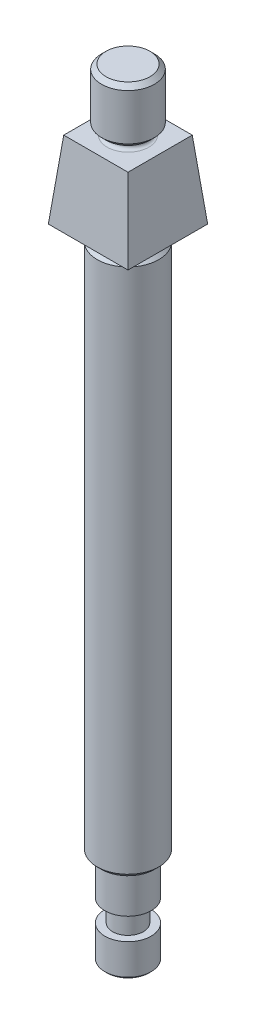
ISO-10303-21;
HEADER;
FILE_DESCRIPTION(('STEP AP214'),'2;1');
FILE_NAME('part.step','',(''),(''),'','','');
FILE_SCHEMA(('AUTOMOTIVE_DESIGN { 1 0 10303 214 1 1 1 1 }'));
ENDSEC;
DATA;
#1=APPLICATION_CONTEXT('core data for automotive mechanical design processes');
#2=APPLICATION_PROTOCOL_DEFINITION('international standard','automotive_design',2000,#1);
#3=PRODUCT_CONTEXT('',#1,'mechanical');
#4=PRODUCT('Part','Part','',(#3));
#5=PRODUCT_RELATED_PRODUCT_CATEGORY('part','',(#4));
#6=PRODUCT_DEFINITION_FORMATION('','',#4);
#7=PRODUCT_DEFINITION_CONTEXT('part definition',#1,'design');
#8=PRODUCT_DEFINITION('design','',#6,#7);
#9=PRODUCT_DEFINITION_SHAPE('','',#8);
#10=(LENGTH_UNIT() NAMED_UNIT(*) SI_UNIT(.MILLI.,.METRE.));
#11=(NAMED_UNIT(*) PLANE_ANGLE_UNIT() SI_UNIT($,.RADIAN.));
#12=(NAMED_UNIT(*) SI_UNIT($,.STERADIAN.) SOLID_ANGLE_UNIT());
#13=UNCERTAINTY_MEASURE_WITH_UNIT(LENGTH_MEASURE(1.E-05),#10,'distance_accuracy_value','');
#14=(GEOMETRIC_REPRESENTATION_CONTEXT(3) GLOBAL_UNCERTAINTY_ASSIGNED_CONTEXT((#13)) GLOBAL_UNIT_ASSIGNED_CONTEXT((#10,
#11,#12)) REPRESENTATION_CONTEXT('',''));
#15=CARTESIAN_POINT('',(0.,0.,0.));
#16=DIRECTION('',(0.,0.,1.));
#17=DIRECTION('',(1.,0.,0.));
#18=AXIS2_PLACEMENT_3D('',#15,#16,#17);
#19=CARTESIAN_POINT('',(0.,42.,0.));
#20=DIRECTION('',(0.,-1.,0.));
#21=DIRECTION('',(0.,0.,-1.));
#22=AXIS2_PLACEMENT_3D('',#19,#20,#21);
#23=CYLINDRICAL_SURFACE('',#22,10.5);
#24=CARTESIAN_POINT('',(0.,25.,0.));
#25=DIRECTION('',(0.,1.,0.));
#26=DIRECTION('',(0.,0.,1.));
#27=AXIS2_PLACEMENT_3D('',#24,#25,#26);
#28=CIRCLE('',#27,10.5);
#29=CARTESIAN_POINT('',(0.,25.,-10.5));
#30=VERTEX_POINT('',#29);
#31=EDGE_CURVE('E214',#30,#30,#28,.T.);
#32=CARTESIAN_POINT('',(0.,42.,0.));
#33=DIRECTION('',(0.,1.,0.));
#34=DIRECTION('',(0.,0.,1.));
#35=AXIS2_PLACEMENT_3D('',#32,#33,#34);
#36=CIRCLE('',#35,10.5);
#37=CARTESIAN_POINT('',(0.,42.,-10.5));
#38=VERTEX_POINT('',#37);
#39=EDGE_CURVE('E94',#38,#38,#36,.T.);
#40=CARTESIAN_POINT('',(0.,25.,-10.5));
#41=CARTESIAN_POINT('',(0.,25.1770833333333,-10.5));
#42=CARTESIAN_POINT('',(0.,25.3541666666667,-10.5));
#43=CARTESIAN_POINT('',(0.,25.7083333333333,-10.5));
#44=CARTESIAN_POINT('',(0.,25.8854166666667,-10.5));
#45=CARTESIAN_POINT('',(0.,26.2395833333333,-10.5));
#46=CARTESIAN_POINT('',(0.,26.4166666666667,-10.5));
#47=CARTESIAN_POINT('',(0.,26.7708333333333,-10.5));
#48=CARTESIAN_POINT('',(0.,26.9479166666667,-10.5));
#49=CARTESIAN_POINT('',(0.,27.3020833333333,-10.5));
#50=CARTESIAN_POINT('',(0.,27.4791666666667,-10.5));
#51=CARTESIAN_POINT('',(0.,27.8333333333333,-10.5));
#52=CARTESIAN_POINT('',(0.,28.0104166666667,-10.5));
#53=CARTESIAN_POINT('',(0.,28.3645833333333,-10.5));
#54=CARTESIAN_POINT('',(0.,28.5416666666667,-10.5));
#55=CARTESIAN_POINT('',(0.,28.8958333333333,-10.5));
#56=CARTESIAN_POINT('',(0.,29.0729166666667,-10.5));
#57=CARTESIAN_POINT('',(0.,29.4270833333333,-10.5));
#58=CARTESIAN_POINT('',(0.,29.6041666666667,-10.5));
#59=CARTESIAN_POINT('',(0.,29.9583333333333,-10.5));
#60=CARTESIAN_POINT('',(0.,30.1354166666667,-10.5));
#61=CARTESIAN_POINT('',(0.,30.4895833333333,-10.5));
#62=CARTESIAN_POINT('',(0.,30.6666666666667,-10.5));
#63=CARTESIAN_POINT('',(0.,31.0208333333333,-10.5));
#64=CARTESIAN_POINT('',(0.,31.1979166666667,-10.5));
#65=CARTESIAN_POINT('',(0.,31.5520833333333,-10.5));
#66=CARTESIAN_POINT('',(0.,31.7291666666667,-10.5));
#67=CARTESIAN_POINT('',(0.,32.0833333333333,-10.5));
#68=CARTESIAN_POINT('',(0.,32.2604166666667,-10.5));
#69=CARTESIAN_POINT('',(0.,32.6145833333333,-10.5));
#70=CARTESIAN_POINT('',(0.,32.7916666666667,-10.5));
#71=CARTESIAN_POINT('',(0.,33.1458333333333,-10.5));
#72=CARTESIAN_POINT('',(0.,33.3229166666667,-10.5));
#73=CARTESIAN_POINT('',(0.,33.6770833333333,-10.5));
#74=CARTESIAN_POINT('',(0.,33.8541666666667,-10.5));
#75=CARTESIAN_POINT('',(0.,34.2083333333333,-10.5));
#76=CARTESIAN_POINT('',(0.,34.3854166666667,-10.5));
#77=CARTESIAN_POINT('',(0.,34.7395833333333,-10.5));
#78=CARTESIAN_POINT('',(0.,34.9166666666667,-10.5));
#79=CARTESIAN_POINT('',(0.,35.2708333333333,-10.5));
#80=CARTESIAN_POINT('',(0.,35.4479166666667,-10.5));
#81=CARTESIAN_POINT('',(0.,35.8020833333333,-10.5));
#82=CARTESIAN_POINT('',(0.,35.9791666666667,-10.5));
#83=CARTESIAN_POINT('',(0.,36.3333333333333,-10.5));
#84=CARTESIAN_POINT('',(0.,36.5104166666667,-10.5));
#85=CARTESIAN_POINT('',(0.,36.8645833333333,-10.5));
#86=CARTESIAN_POINT('',(0.,37.0416666666667,-10.5));
#87=CARTESIAN_POINT('',(0.,37.3958333333333,-10.5));
#88=CARTESIAN_POINT('',(0.,37.5729166666667,-10.5));
#89=CARTESIAN_POINT('',(0.,37.9270833333333,-10.5));
#90=CARTESIAN_POINT('',(0.,38.1041666666667,-10.5));
#91=CARTESIAN_POINT('',(0.,38.4583333333333,-10.5));
#92=CARTESIAN_POINT('',(0.,38.6354166666667,-10.5));
#93=CARTESIAN_POINT('',(0.,38.9895833333333,-10.5));
#94=CARTESIAN_POINT('',(0.,39.1666666666667,-10.5));
#95=CARTESIAN_POINT('',(0.,39.5208333333333,-10.5));
#96=CARTESIAN_POINT('',(0.,39.6979166666667,-10.5));
#97=CARTESIAN_POINT('',(0.,40.0520833333333,-10.5));
#98=CARTESIAN_POINT('',(0.,40.2291666666667,-10.5));
#99=CARTESIAN_POINT('',(0.,40.5833333333333,-10.5));
#100=CARTESIAN_POINT('',(0.,40.7604166666667,-10.5));
#101=CARTESIAN_POINT('',(0.,41.1145833333333,-10.5));
#102=CARTESIAN_POINT('',(0.,41.2916666666667,-10.5));
#103=CARTESIAN_POINT('',(0.,41.6458333333333,-10.5));
#104=CARTESIAN_POINT('',(0.,41.8229166666667,-10.5));
#105=CARTESIAN_POINT('',(0.,42.,-10.5));
#106=B_SPLINE_CURVE_WITH_KNOTS('',3,(#40,#41,#42,#43,#44,#45,#46,#47,#48,#49,#50,#51,#52,#53,
#54,#55,#56,#57,#58,#59,#60,#61,#62,#63,#64,#65,#66,#67,#68,#69,#70,#71,#72,#73,#74,#75,#76,#77,
#78,#79,#80,#81,#82,#83,#84,#85,#86,#87,#88,#89,#90,#91,#92,#93,#94,#95,#96,#97,#98,#99,#100,
#101,#102,#103,#104,#105),.UNSPECIFIED.,.F.,.F.,(4,2,2,2,2,2,2,2,2,2,2,2,2,2,2,2,2,2,2,2,2,2,2,
2,2,2,2,2,2,2,2,2,4),(0.,0.53125,1.0625,1.59375,2.125,2.65625,3.1875,3.71875,4.25,4.78125,
5.3125,5.84375,6.375,6.90625,7.4375,7.96875,8.5,9.03124999999999,9.5625,10.09375,10.625,
11.15625,11.6875,12.21875,12.75,13.28125,13.8125,14.34375,14.875,15.40625,15.9375,16.46875,17.),.UNSPECIFIED.);
#107=EDGE_CURVE('BSEAM35',#30,#38,#106,.T.);
#108=ORIENTED_EDGE('',*,*,#31,.T.);
#109=ORIENTED_EDGE('',*,*,#39,.F.);
#110=ORIENTED_EDGE('',*,*,#107,.T.);
#111=ORIENTED_EDGE('',*,*,#107,.F.);
#112=EDGE_LOOP('',(#108,#110,#109,#111));
#113=FACE_BOUND('',#112,.T.);
#114=ADVANCED_FACE('F35',(#113),#23,.T.);
#115=CARTESIAN_POINT('',(0.,285.,0.));
#116=DIRECTION('',(0.,-1.,0.));
#117=DIRECTION('',(0.,0.,-1.));
#118=AXIS2_PLACEMENT_3D('',#115,#116,#117);
#119=CYLINDRICAL_SURFACE('',#118,14.);
#120=CARTESIAN_POINT('',(0.,283.,0.));
#121=DIRECTION('',(0.,1.,0.));
#122=DIRECTION('',(0.,0.,1.));
#123=AXIS2_PLACEMENT_3D('',#120,#121,#122);
#124=CIRCLE('',#123,14.);
#125=CARTESIAN_POINT('',(0.,283.,14.));
#126=VERTEX_POINT('',#125);
#127=EDGE_CURVE('E147',#126,#126,#124,.F.);
#128=ORIENTED_EDGE('',*,*,#127,.T.);
#129=EDGE_LOOP('',(#128));
#130=FACE_BOUND('',#129,.T.);
#131=CARTESIAN_POINT('',(0.,44.,0.));
#132=DIRECTION('',(0.,1.,0.));
#133=DIRECTION('',(0.,0.,1.));
#134=AXIS2_PLACEMENT_3D('',#131,#132,#133);
#135=CIRCLE('',#134,14.);
#136=CARTESIAN_POINT('',(0.,44.,14.));
#137=VERTEX_POINT('',#136);
#138=EDGE_CURVE('E144',#137,#137,#135,.T.);
#139=ORIENTED_EDGE('',*,*,#138,.T.);
#140=EDGE_LOOP('',(#139));
#141=FACE_BOUND('',#140,.T.);
#142=ADVANCED_FACE('F176',(#130,#141),#119,.T.);
#143=CARTESIAN_POINT('',(0.,285.,0.));
#144=DIRECTION('',(0.,1.,0.));
#145=DIRECTION('',(0.,0.,1.));
#146=AXIS2_PLACEMENT_3D('',#143,#144,#145);
#147=PLANE('',#146);
#148=CARTESIAN_POINT('',(0.,285.,0.));
#149=DIRECTION('',(0.,1.,0.));
#150=DIRECTION('',(0.,0.,1.));
#151=AXIS2_PLACEMENT_3D('',#148,#149,#150);
#152=CIRCLE('',#151,12.);
#153=CARTESIAN_POINT('',(0.,285.,12.));
#154=VERTEX_POINT('',#153);
#155=EDGE_CURVE('E140',#154,#154,#152,.T.);
#156=ORIENTED_EDGE('',*,*,#155,.T.);
#157=EDGE_LOOP('',(#156));
#158=FACE_BOUND('',#157,.T.);
#159=CARTESIAN_POINT('',(0.,285.,0.));
#160=DIRECTION('',(0.,1.,0.));
#161=DIRECTION('',(0.,0.,1.));
#162=AXIS2_PLACEMENT_3D('',#159,#160,#161);
#163=CIRCLE('',#162,11.5);
#164=CARTESIAN_POINT('',(0.,285.,11.5));
#165=VERTEX_POINT('',#164);
#166=EDGE_CURVE('E135',#165,#165,#163,.F.);
#167=ORIENTED_EDGE('',*,*,#166,.T.);
#168=EDGE_LOOP('',(#167));
#169=FACE_BOUND('',#168,.T.);
#170=ADVANCED_FACE('F183',(#158,#169),#147,.T.);
#171=CARTESIAN_POINT('',(0.,42.,0.));
#172=DIRECTION('',(0.,1.,0.));
#173=DIRECTION('',(0.,0.,1.));
#174=AXIS2_PLACEMENT_3D('',#171,#172,#173);
#175=PLANE('',#174);
#176=CARTESIAN_POINT('',(0.,42.,0.));
#177=DIRECTION('',(0.,1.,0.));
#178=DIRECTION('',(0.,0.,1.));
#179=AXIS2_PLACEMENT_3D('',#176,#177,#178);
#180=CIRCLE('',#179,11.9999999999999);
#181=CARTESIAN_POINT('',(0.,42.,11.9999999999999));
#182=VERTEX_POINT('',#181);
#183=EDGE_CURVE('E150',#182,#182,#180,.F.);
#184=ORIENTED_EDGE('',*,*,#183,.T.);
#185=EDGE_LOOP('',(#184));
#186=FACE_BOUND('',#185,.T.);
#187=ORIENTED_EDGE('',*,*,#39,.T.);
#188=EDGE_LOOP('',(#187));
#189=FACE_BOUND('',#188,.T.);
#190=ADVANCED_FACE('F258',(#186,#189),#175,.F.);
#191=CARTESIAN_POINT('',(18.1,290.,18.1));
#192=DIRECTION('',(0.995037190209989,0.0995037190209992,0.));
#193=DIRECTION('',(-0.0995037190209992,0.995037190209989,0.));
#194=AXIS2_PLACEMENT_3D('',#191,#192,#193);
#195=PLANE('',#194);
#196=DIRECTION('',(0.,0.,-1.));
#197=VECTOR('',#196,1.);
#198=CARTESIAN_POINT('',(18.1,290.,18.1));
#199=LINE('',#198,#197);
#200=CARTESIAN_POINT('',(18.1,290.,18.1));
#201=VERTEX_POINT('',#200);
#202=CARTESIAN_POINT('',(18.1,290.,-18.1));
#203=VERTEX_POINT('',#202);
#204=EDGE_CURVE('E82',#201,#203,#199,.T.);
#205=ORIENTED_EDGE('',*,*,#204,.T.);
#206=DIRECTION('',(0.0990147542976677,-0.990147542976674,-0.0990147542976677));
#207=VECTOR('',#206,1.);
#208=CARTESIAN_POINT('',(17.7450980392157,293.549019607843,-17.7450980392157));
#209=LINE('',#208,#207);
#210=CARTESIAN_POINT('',(14.6,325.,-14.6));
#211=VERTEX_POINT('',#210);
#212=EDGE_CURVE('E89',#211,#203,#209,.T.);
#213=ORIENTED_EDGE('',*,*,#212,.F.);
#214=DIRECTION('',(0.,0.,1.));
#215=VECTOR('',#214,1.);
#216=CARTESIAN_POINT('',(14.6,325.,0.));
#217=LINE('',#216,#215);
#218=CARTESIAN_POINT('',(14.6,325.,14.6));
#219=VERTEX_POINT('',#218);
#220=EDGE_CURVE('E110',#219,#211,#217,.F.);
#221=ORIENTED_EDGE('',*,*,#220,.F.);
#222=DIRECTION('',(0.0990147542976677,-0.990147542976674,0.0990147542976677));
#223=VECTOR('',#222,1.);
#224=CARTESIAN_POINT('',(18.1,290.,18.1));
#225=LINE('',#224,#223);
#226=EDGE_CURVE('E99',#219,#201,#225,.T.);
#227=ORIENTED_EDGE('',*,*,#226,.T.);
#228=EDGE_LOOP('',(#205,#213,#221,#227));
#229=FACE_BOUND('',#228,.T.);
#230=ADVANCED_FACE('F98',(#229),#195,.T.);
#231=CARTESIAN_POINT('',(-18.1,290.,-18.1));
#232=DIRECTION('',(0.,0.0995037190209992,-0.995037190209989));
#233=DIRECTION('',(0.,0.995037190209989,0.0995037190209992));
#234=AXIS2_PLACEMENT_3D('',#231,#232,#233);
#235=PLANE('',#234);
#236=DIRECTION('',(-1.,0.,0.));
#237=VECTOR('',#236,1.);
#238=CARTESIAN_POINT('',(-18.1,290.,-18.1));
#239=LINE('',#238,#237);
#240=CARTESIAN_POINT('',(-18.1,290.,-18.1));
#241=VERTEX_POINT('',#240);
#242=EDGE_CURVE('E77',#203,#241,#239,.T.);
#243=ORIENTED_EDGE('',*,*,#242,.T.);
#244=DIRECTION('',(-0.0990147542976677,-0.990147542976674,-0.0990147542976677));
#245=VECTOR('',#244,1.);
#246=CARTESIAN_POINT('',(-17.7450980392157,293.549019607843,-17.7450980392157));
#247=LINE('',#246,#245);
#248=CARTESIAN_POINT('',(-14.6,325.,-14.6));
#249=VERTEX_POINT('',#248);
#250=EDGE_CURVE('E95',#249,#241,#247,.T.);
#251=ORIENTED_EDGE('',*,*,#250,.F.);
#252=DIRECTION('',(1.,0.,0.));
#253=VECTOR('',#252,1.);
#254=CARTESIAN_POINT('',(0.,325.,-14.6));
#255=LINE('',#254,#253);
#256=EDGE_CURVE('E91',#211,#249,#255,.F.);
#257=ORIENTED_EDGE('',*,*,#256,.F.);
#258=ORIENTED_EDGE('',*,*,#212,.T.);
#259=EDGE_LOOP('',(#243,#251,#257,#258));
#260=FACE_BOUND('',#259,.T.);
#261=ADVANCED_FACE('F90',(#260),#235,.T.);
#262=CARTESIAN_POINT('',(-18.1,290.,18.1));
#263=DIRECTION('',(-0.995037190209989,0.0995037190209992,0.));
#264=DIRECTION('',(-0.0995037190209992,-0.995037190209989,0.));
#265=AXIS2_PLACEMENT_3D('',#262,#263,#264);
#266=PLANE('',#265);
#267=DIRECTION('',(0.,0.,1.));
#268=VECTOR('',#267,1.);
#269=CARTESIAN_POINT('',(-18.1,290.,18.1));
#270=LINE('',#269,#268);
#271=CARTESIAN_POINT('',(-18.1,290.,18.1));
#272=VERTEX_POINT('',#271);
#273=EDGE_CURVE('E83',#241,#272,#270,.T.);
#274=ORIENTED_EDGE('',*,*,#273,.T.);
#275=DIRECTION('',(-0.0990147542976677,-0.990147542976674,0.0990147542976677));
#276=VECTOR('',#275,1.);
#277=CARTESIAN_POINT('',(-18.1,290.,18.1));
#278=LINE('',#277,#276);
#279=CARTESIAN_POINT('',(-14.6,325.,14.6));
#280=VERTEX_POINT('',#279);
#281=EDGE_CURVE('E113',#280,#272,#278,.T.);
#282=ORIENTED_EDGE('',*,*,#281,.F.);
#283=DIRECTION('',(0.,0.,-1.));
#284=VECTOR('',#283,1.);
#285=CARTESIAN_POINT('',(-14.6,325.,0.));
#286=LINE('',#285,#284);
#287=EDGE_CURVE('E56',#249,#280,#286,.F.);
#288=ORIENTED_EDGE('',*,*,#287,.F.);
#289=ORIENTED_EDGE('',*,*,#250,.T.);
#290=EDGE_LOOP('',(#274,#282,#288,#289));
#291=FACE_BOUND('',#290,.T.);
#292=ADVANCED_FACE('F261',(#291),#266,.T.);
#293=CARTESIAN_POINT('',(-18.1,290.,18.1));
#294=DIRECTION('',(0.,0.0995037190209992,0.995037190209989));
#295=DIRECTION('',(0.,-0.995037190209989,0.0995037190209992));
#296=AXIS2_PLACEMENT_3D('',#293,#294,#295);
#297=PLANE('',#296);
#298=DIRECTION('',(1.,0.,0.));
#299=VECTOR('',#298,1.);
#300=CARTESIAN_POINT('',(-18.1,290.,18.1));
#301=LINE('',#300,#299);
#302=EDGE_CURVE('E109',#272,#201,#301,.T.);
#303=ORIENTED_EDGE('',*,*,#302,.T.);
#304=ORIENTED_EDGE('',*,*,#226,.F.);
#305=DIRECTION('',(-1.,0.,0.));
#306=VECTOR('',#305,1.);
#307=CARTESIAN_POINT('',(0.,325.,14.6));
#308=LINE('',#307,#306);
#309=EDGE_CURVE('E51',#280,#219,#308,.F.);
#310=ORIENTED_EDGE('',*,*,#309,.F.);
#311=ORIENTED_EDGE('',*,*,#281,.T.);
#312=EDGE_LOOP('',(#303,#304,#310,#311));
#313=FACE_BOUND('',#312,.T.);
#314=ADVANCED_FACE('F251',(#313),#297,.T.);
#315=CARTESIAN_POINT('',(0.,325.,0.));
#316=DIRECTION('',(0.,-1.,0.));
#317=DIRECTION('',(0.,0.,-1.));
#318=AXIS2_PLACEMENT_3D('',#315,#316,#317);
#319=PLANE('',#318);
#320=CARTESIAN_POINT('',(0.,325.,0.));
#321=DIRECTION('',(0.,-1.,0.));
#322=DIRECTION('',(0.,0.,-1.));
#323=AXIS2_PLACEMENT_3D('',#320,#321,#322);
#324=CIRCLE('',#323,9.5);
#325=CARTESIAN_POINT('',(0.,325.,-9.5));
#326=VERTEX_POINT('',#325);
#327=EDGE_CURVE('E11',#326,#326,#324,.T.);
#328=ORIENTED_EDGE('',*,*,#327,.T.);
#329=EDGE_LOOP('',(#328));
#330=FACE_BOUND('',#329,.T.);
#331=ORIENTED_EDGE('',*,*,#220,.T.);
#332=ORIENTED_EDGE('',*,*,#256,.T.);
#333=ORIENTED_EDGE('',*,*,#287,.T.);
#334=ORIENTED_EDGE('',*,*,#309,.T.);
#335=EDGE_LOOP('',(#331,#332,#333,#334));
#336=FACE_BOUND('',#335,.T.);
#337=ADVANCED_FACE('F248',(#330,#336),#319,.F.);
#338=CARTESIAN_POINT('',(0.,290.,0.));
#339=DIRECTION('',(0.,-1.,0.));
#340=DIRECTION('',(0.,0.,-1.));
#341=AXIS2_PLACEMENT_3D('',#338,#339,#340);
#342=PLANE('',#341);
#343=CARTESIAN_POINT('',(0.,290.,0.));
#344=DIRECTION('',(0.,-1.,0.));
#345=DIRECTION('',(0.,0.,-1.));
#346=AXIS2_PLACEMENT_3D('',#343,#344,#345);
#347=CIRCLE('',#346,11.5);
#348=CARTESIAN_POINT('',(0.,290.,-11.5));
#349=VERTEX_POINT('',#348);
#350=EDGE_CURVE('E138',#349,#349,#347,.F.);
#351=ORIENTED_EDGE('',*,*,#350,.T.);
#352=EDGE_LOOP('',(#351));
#353=FACE_BOUND('',#352,.T.);
#354=ORIENTED_EDGE('',*,*,#204,.F.);
#355=ORIENTED_EDGE('',*,*,#302,.F.);
#356=ORIENTED_EDGE('',*,*,#273,.F.);
#357=ORIENTED_EDGE('',*,*,#242,.F.);
#358=EDGE_LOOP('',(#354,#355,#356,#357));
#359=FACE_BOUND('',#358,.T.);
#360=ADVANCED_FACE('F79',(#353,#359),#342,.T.);
#361=CARTESIAN_POINT('',(0.,353.,0.));
#362=DIRECTION('',(0.,-1.,0.));
#363=DIRECTION('',(0.,0.,-1.));
#364=AXIS2_PLACEMENT_3D('',#361,#362,#363);
#365=CYLINDRICAL_SURFACE('',#364,12.);
#366=CARTESIAN_POINT('',(0.,330.,0.));
#367=DIRECTION('',(0.,1.,0.));
#368=DIRECTION('',(0.,0.,1.));
#369=AXIS2_PLACEMENT_3D('',#366,#367,#368);
#370=CIRCLE('',#369,12.);
#371=CARTESIAN_POINT('',(0.,330.,12.));
#372=VERTEX_POINT('',#371);
#373=EDGE_CURVE('E126',#372,#372,#370,.T.);
#374=ORIENTED_EDGE('',*,*,#373,.T.);
#375=EDGE_LOOP('',(#374));
#376=FACE_BOUND('',#375,.T.);
#377=CARTESIAN_POINT('',(0.,351.,0.));
#378=DIRECTION('',(0.,1.,0.));
#379=DIRECTION('',(0.,0.,1.));
#380=AXIS2_PLACEMENT_3D('',#377,#378,#379);
#381=CIRCLE('',#380,12.);
#382=CARTESIAN_POINT('',(0.,351.,12.));
#383=VERTEX_POINT('',#382);
#384=EDGE_CURVE('E123',#383,#383,#381,.F.);
#385=ORIENTED_EDGE('',*,*,#384,.T.);
#386=EDGE_LOOP('',(#385));
#387=FACE_BOUND('',#386,.T.);
#388=ADVANCED_FACE('F240',(#376,#387),#365,.T.);
#389=CARTESIAN_POINT('',(0.,353.,0.));
#390=DIRECTION('',(0.,1.,0.));
#391=DIRECTION('',(0.,0.,1.));
#392=AXIS2_PLACEMENT_3D('',#389,#390,#391);
#393=PLANE('',#392);
#394=CARTESIAN_POINT('',(0.,353.,0.));
#395=DIRECTION('',(0.,1.,0.));
#396=DIRECTION('',(0.,0.,1.));
#397=AXIS2_PLACEMENT_3D('',#394,#395,#396);
#398=CIRCLE('',#397,10.0000000000001);
#399=CARTESIAN_POINT('',(0.,353.,10.0000000000001));
#400=VERTEX_POINT('',#399);
#401=EDGE_CURVE('E132',#400,#400,#398,.T.);
#402=ORIENTED_EDGE('',*,*,#401,.T.);
#403=EDGE_LOOP('',(#402));
#404=FACE_BOUND('',#403,.T.);
#405=ADVANCED_FACE('F237',(#404),#393,.T.);
#406=CARTESIAN_POINT('',(0.,328.,0.));
#407=DIRECTION('',(0.,1.,0.));
#408=DIRECTION('',(0.,0.,1.));
#409=AXIS2_PLACEMENT_3D('',#406,#407,#408);
#410=PLANE('',#409);
#411=CARTESIAN_POINT('',(0.,328.,0.));
#412=DIRECTION('',(0.,1.,0.));
#413=DIRECTION('',(0.,0.,1.));
#414=AXIS2_PLACEMENT_3D('',#411,#412,#413);
#415=CIRCLE('',#414,9.5);
#416=CARTESIAN_POINT('',(0.,328.,9.5));
#417=VERTEX_POINT('',#416);
#418=EDGE_CURVE('E44',#417,#417,#415,.T.);
#419=ORIENTED_EDGE('',*,*,#418,.T.);
#420=EDGE_LOOP('',(#419));
#421=FACE_BOUND('',#420,.T.);
#422=CARTESIAN_POINT('',(0.,328.,0.));
#423=DIRECTION('',(0.,1.,0.));
#424=DIRECTION('',(0.,0.,1.));
#425=AXIS2_PLACEMENT_3D('',#422,#423,#424);
#426=CIRCLE('',#425,10.);
#427=CARTESIAN_POINT('',(0.,328.,10.));
#428=VERTEX_POINT('',#427);
#429=EDGE_CURVE('E129',#428,#428,#426,.F.);
#430=ORIENTED_EDGE('',*,*,#429,.T.);
#431=EDGE_LOOP('',(#430));
#432=FACE_BOUND('',#431,.T.);
#433=ADVANCED_FACE('F162',(#421,#432),#410,.F.);
#434=CARTESIAN_POINT('',(0.,330.,0.));
#435=DIRECTION('',(0.,1.,0.));
#436=DIRECTION('',(0.,0.,1.));
#437=AXIS2_PLACEMENT_3D('',#434,#435,#436);
#438=CONICAL_SURFACE('',#437,12.,0.785398163397432);
#439=ORIENTED_EDGE('',*,*,#429,.F.);
#440=EDGE_LOOP('',(#439));
#441=FACE_BOUND('',#440,.T.);
#442=ORIENTED_EDGE('',*,*,#373,.F.);
#443=EDGE_LOOP('',(#442));
#444=FACE_BOUND('',#443,.T.);
#445=ADVANCED_FACE('F244',(#441,#444),#438,.T.);
#446=CARTESIAN_POINT('',(0.,353.,0.));
#447=DIRECTION('',(0.,-1.,0.));
#448=DIRECTION('',(0.,0.,-1.));
#449=AXIS2_PLACEMENT_3D('',#446,#447,#448);
#450=CONICAL_SURFACE('',#449,10.0000000000001,0.785398163397432);
#451=ORIENTED_EDGE('',*,*,#384,.F.);
#452=EDGE_LOOP('',(#451));
#453=FACE_BOUND('',#452,.T.);
#454=ORIENTED_EDGE('',*,*,#401,.F.);
#455=EDGE_LOOP('',(#454));
#456=FACE_BOUND('',#455,.T.);
#457=ADVANCED_FACE('F302',(#453,#456),#450,.T.);
#458=CARTESIAN_POINT('',(0.,287.5,0.));
#459=DIRECTION('',(0.,-1.,0.));
#460=DIRECTION('',(0.,0.,-1.));
#461=AXIS2_PLACEMENT_3D('',#458,#459,#460);
#462=TOROIDAL_SURFACE('',#461,11.5,2.5);
#463=ORIENTED_EDGE('',*,*,#350,.F.);
#464=EDGE_LOOP('',(#463));
#465=FACE_BOUND('',#464,.T.);
#466=CARTESIAN_POINT('',(0.,287.5,0.));
#467=DIRECTION('',(0.,-1.,0.));
#468=DIRECTION('',(0.,0.,-1.));
#469=AXIS2_PLACEMENT_3D('',#466,#467,#468);
#470=CIRCLE('',#469,9.);
#471=CARTESIAN_POINT('',(0.,287.5,-9.));
#472=VERTEX_POINT('',#471);
#473=EDGE_CURVE('E100',#472,#472,#470,.T.);
#474=ORIENTED_EDGE('',*,*,#473,.F.);
#475=EDGE_LOOP('',(#474));
#476=FACE_BOUND('',#475,.T.);
#477=ADVANCED_FACE('F299',(#465,#476),#462,.F.);
#478=CARTESIAN_POINT('',(0.,287.5,0.));
#479=DIRECTION('',(0.,1.,0.));
#480=DIRECTION('',(0.,0.,1.));
#481=AXIS2_PLACEMENT_3D('',#478,#479,#480);
#482=TOROIDAL_SURFACE('',#481,11.5,2.5);
#483=ORIENTED_EDGE('',*,*,#166,.F.);
#484=EDGE_LOOP('',(#483));
#485=FACE_BOUND('',#484,.T.);
#486=ORIENTED_EDGE('',*,*,#473,.T.);
#487=EDGE_LOOP('',(#486));
#488=FACE_BOUND('',#487,.T.);
#489=ADVANCED_FACE('F233',(#485,#488),#482,.F.);
#490=CARTESIAN_POINT('',(-10.5,15.,0.));
#491=DIRECTION('',(0.,-1.,0.));
#492=DIRECTION('',(0.,0.,-1.));
#493=AXIS2_PLACEMENT_3D('',#490,#491,#492);
#494=PLANE('',#493);
#495=CARTESIAN_POINT('',(0.,15.,0.));
#496=DIRECTION('',(0.,1.,0.));
#497=DIRECTION('',(0.,0.,1.));
#498=AXIS2_PLACEMENT_3D('',#495,#496,#497);
#499=CIRCLE('',#498,7.);
#500=CARTESIAN_POINT('',(0.,15.,7.));
#501=VERTEX_POINT('',#500);
#502=EDGE_CURVE('E208',#501,#501,#499,.T.);
#503=ORIENTED_EDGE('',*,*,#502,.F.);
#504=EDGE_LOOP('',(#503));
#505=FACE_BOUND('',#504,.T.);
#506=CARTESIAN_POINT('',(0.,15.,0.));
#507=DIRECTION('',(0.,1.,0.));
#508=DIRECTION('',(0.,0.,1.));
#509=AXIS2_PLACEMENT_3D('',#506,#507,#508);
#510=CIRCLE('',#509,10.5);
#511=CARTESIAN_POINT('',(0.,15.,-10.5));
#512=VERTEX_POINT('',#511);
#513=EDGE_CURVE('E103',#512,#512,#510,.T.);
#514=ORIENTED_EDGE('',*,*,#513,.T.);
#515=EDGE_LOOP('',(#514));
#516=FACE_BOUND('',#515,.T.);
#517=ADVANCED_FACE('F228',(#505,#516),#494,.F.);
#518=CARTESIAN_POINT('',(0.,42.,0.));
#519=DIRECTION('',(0.,1.,0.));
#520=DIRECTION('',(0.,0.,1.));
#521=AXIS2_PLACEMENT_3D('',#518,#519,#520);
#522=CYLINDRICAL_SURFACE('',#521,7.);
#523=CARTESIAN_POINT('',(0.,25.,0.));
#524=DIRECTION('',(0.,1.,0.));
#525=DIRECTION('',(0.,0.,1.));
#526=AXIS2_PLACEMENT_3D('',#523,#524,#525);
#527=CIRCLE('',#526,7.);
#528=CARTESIAN_POINT('',(0.,25.,7.));
#529=VERTEX_POINT('',#528);
#530=EDGE_CURVE('E210',#529,#529,#527,.T.);
#531=ORIENTED_EDGE('',*,*,#530,.F.);
#532=EDGE_LOOP('',(#531));
#533=FACE_BOUND('',#532,.T.);
#534=ORIENTED_EDGE('',*,*,#502,.T.);
#535=EDGE_LOOP('',(#534));
#536=FACE_BOUND('',#535,.T.);
#537=ADVANCED_FACE('F223',(#533,#536),#522,.T.);
#538=CARTESIAN_POINT('',(-10.5,25.,0.));
#539=DIRECTION('',(0.,1.,0.));
#540=DIRECTION('',(0.,0.,1.));
#541=AXIS2_PLACEMENT_3D('',#538,#539,#540);
#542=PLANE('',#541);
#543=ORIENTED_EDGE('',*,*,#31,.F.);
#544=EDGE_LOOP('',(#543));
#545=FACE_BOUND('',#544,.T.);
#546=ORIENTED_EDGE('',*,*,#530,.T.);
#547=EDGE_LOOP('',(#546));
#548=FACE_BOUND('',#547,.T.);
#549=ADVANCED_FACE('F201',(#545,#548),#542,.F.);
#550=CARTESIAN_POINT('',(0.,0.,0.));
#551=DIRECTION('',(0.,1.,0.));
#552=DIRECTION('',(0.,0.,1.));
#553=AXIS2_PLACEMENT_3D('',#550,#551,#552);
#554=PLANE('',#553);
#555=CARTESIAN_POINT('',(0.,0.,0.));
#556=DIRECTION('',(0.,1.,0.));
#557=DIRECTION('',(0.,0.,1.));
#558=AXIS2_PLACEMENT_3D('',#555,#556,#557);
#559=CIRCLE('',#558,9.49999999999984);
#560=CARTESIAN_POINT('',(0.,0.,9.49999999999984));
#561=VERTEX_POINT('',#560);
#562=EDGE_CURVE('E156',#561,#561,#559,.F.);
#563=ORIENTED_EDGE('',*,*,#562,.T.);
#564=EDGE_LOOP('',(#563));
#565=FACE_BOUND('',#564,.T.);
#566=ADVANCED_FACE('F192',(#565),#554,.F.);
#567=CARTESIAN_POINT('',(0.,1.00000000000012,0.));
#568=DIRECTION('',(0.,1.,0.));
#569=DIRECTION('',(0.,0.,1.));
#570=AXIS2_PLACEMENT_3D('',#567,#568,#569);
#571=CIRCLE('',#570,10.5);
#572=CARTESIAN_POINT('',(0.,1.00000000000011,-10.5));
#573=VERTEX_POINT('',#572);
#574=EDGE_CURVE('E153',#573,#573,#571,.T.);
#575=CARTESIAN_POINT('',(0.,1.00000000000011,-10.5));
#576=CARTESIAN_POINT('',(0.,1.14583333333344,-10.5));
#577=CARTESIAN_POINT('',(0.,1.29166666666677,-10.5));
#578=CARTESIAN_POINT('',(0.,1.58333333333344,-10.5));
#579=CARTESIAN_POINT('',(0.,1.72916666666677,-10.5));
#580=CARTESIAN_POINT('',(0.,2.02083333333344,-10.5));
#581=CARTESIAN_POINT('',(0.,2.16666666666677,-10.5));
#582=CARTESIAN_POINT('',(0.,2.45833333333343,-10.5));
#583=CARTESIAN_POINT('',(0.,2.60416666666677,-10.5));
#584=CARTESIAN_POINT('',(0.,2.89583333333343,-10.5));
#585=CARTESIAN_POINT('',(0.,3.04166666666676,-10.5));
#586=CARTESIAN_POINT('',(0.,3.33333333333343,-10.5));
#587=CARTESIAN_POINT('',(0.,3.47916666666676,-10.5));
#588=CARTESIAN_POINT('',(0.,3.77083333333342,-10.5));
#589=CARTESIAN_POINT('',(0.,3.91666666666676,-10.5));
#590=CARTESIAN_POINT('',(0.,4.20833333333342,-10.5));
#591=CARTESIAN_POINT('',(0.,4.35416666666675,-10.5));
#592=CARTESIAN_POINT('',(0.,4.64583333333342,-10.5));
#593=CARTESIAN_POINT('',(0.,4.79166666666675,-10.5));
#594=CARTESIAN_POINT('',(0.,5.08333333333341,-10.5));
#595=CARTESIAN_POINT('',(0.,5.22916666666675,-10.5));
#596=CARTESIAN_POINT('',(0.,5.52083333333341,-10.5));
#597=CARTESIAN_POINT('',(0.,5.66666666666674,-10.5));
#598=CARTESIAN_POINT('',(0.,5.95833333333341,-10.5));
#599=CARTESIAN_POINT('',(0.,6.10416666666674,-10.5));
#600=CARTESIAN_POINT('',(0.,6.39583333333341,-10.5));
#601=CARTESIAN_POINT('',(0.,6.54166666666674,-10.5));
#602=CARTESIAN_POINT('',(0.,6.8333333333334,-10.5));
#603=CARTESIAN_POINT('',(0.,6.97916666666673,-10.5));
#604=CARTESIAN_POINT('',(0.,7.2708333333334,-10.5));
#605=CARTESIAN_POINT('',(0.,7.41666666666673,-10.5));
#606=CARTESIAN_POINT('',(0.,7.7083333333334,-10.5));
#607=CARTESIAN_POINT('',(0.,7.85416666666673,-10.5));
#608=CARTESIAN_POINT('',(0.,8.14583333333339,-10.5));
#609=CARTESIAN_POINT('',(0.,8.29166666666672,-10.5));
#610=CARTESIAN_POINT('',(0.,8.58333333333339,-10.5));
#611=CARTESIAN_POINT('',(0.,8.72916666666672,-10.5));
#612=CARTESIAN_POINT('',(0.,9.02083333333338,-10.5));
#613=CARTESIAN_POINT('',(0.,9.16666666666672,-10.5));
#614=CARTESIAN_POINT('',(0.,9.45833333333338,-10.5));
#615=CARTESIAN_POINT('',(0.,9.60416666666672,-10.5));
#616=CARTESIAN_POINT('',(0.,9.89583333333338,-10.5));
#617=CARTESIAN_POINT('',(0.,10.0416666666667,-10.5));
#618=CARTESIAN_POINT('',(0.,10.3333333333334,-10.5));
#619=CARTESIAN_POINT('',(0.,10.4791666666667,-10.5));
#620=CARTESIAN_POINT('',(0.,10.7708333333334,-10.5));
#621=CARTESIAN_POINT('',(0.,10.9166666666667,-10.5));
#622=CARTESIAN_POINT('',(0.,11.2083333333334,-10.5));
#623=CARTESIAN_POINT('',(0.,11.3541666666667,-10.5));
#624=CARTESIAN_POINT('',(0.,11.6458333333334,-10.5));
#625=CARTESIAN_POINT('',(0.,11.7916666666667,-10.5));
#626=CARTESIAN_POINT('',(0.,12.0833333333334,-10.5));
#627=CARTESIAN_POINT('',(0.,12.2291666666667,-10.5));
#628=CARTESIAN_POINT('',(0.,12.5208333333334,-10.5));
#629=CARTESIAN_POINT('',(0.,12.6666666666667,-10.5));
#630=CARTESIAN_POINT('',(0.,12.9583333333334,-10.5));
#631=CARTESIAN_POINT('',(0.,13.1041666666667,-10.5));
#632=CARTESIAN_POINT('',(0.,13.3958333333333,-10.5));
#633=CARTESIAN_POINT('',(0.,13.5416666666667,-10.5));
#634=CARTESIAN_POINT('',(0.,13.8333333333333,-10.5));
#635=CARTESIAN_POINT('',(0.,13.9791666666667,-10.5));
#636=CARTESIAN_POINT('',(0.,14.2708333333333,-10.5));
#637=CARTESIAN_POINT('',(0.,14.4166666666667,-10.5));
#638=CARTESIAN_POINT('',(0.,14.7083333333333,-10.5));
#639=CARTESIAN_POINT('',(0.,14.8541666666667,-10.5));
#640=CARTESIAN_POINT('',(0.,15.,-10.5));
#641=B_SPLINE_CURVE_WITH_KNOTS('',3,(#575,#576,#577,#578,#579,#580,#581,#582,#583,#584,#585,
#586,#587,#588,#589,#590,#591,#592,#593,#594,#595,#596,#597,#598,#599,#600,#601,#602,#603,#604,
#605,#606,#607,#608,#609,#610,#611,#612,#613,#614,#615,#616,#617,#618,#619,#620,#621,#622,#623,
#624,#625,#626,#627,#628,#629,#630,#631,#632,#633,#634,#635,#636,#637,#638,#639,#640),
.UNSPECIFIED.,.F.,.F.,(4,2,2,2,2,2,2,2,2,2,2,2,2,2,2,2,2,2,2,2,2,2,2,2,2,2,2,2,2,2,2,2,4),(0.,
0.437499999999993,0.874999999999994,1.31249999999999,1.74999999999999,2.18749999999998,
2.62499999999998,3.06249999999998,3.49999999999998,3.93749999999997,4.37499999999997,
4.81249999999996,5.24999999999996,5.68749999999996,6.12499999999995,6.56249999999995,
6.99999999999995,7.43749999999994,7.87499999999994,8.31249999999994,8.74999999999994,
9.18749999999993,9.62499999999993,10.0624999999999,10.4999999999999,10.9374999999999,
11.3749999999999,11.8124999999999,12.2499999999999,12.6874999999999,13.1249999999999,
13.5624999999999,13.9999999999999),.UNSPECIFIED.);
#642=EDGE_CURVE('BSEAM179',#573,#512,#641,.T.);
#643=ORIENTED_EDGE('',*,*,#574,.T.);
#644=ORIENTED_EDGE('',*,*,#513,.F.);
#645=ORIENTED_EDGE('',*,*,#642,.T.);
#646=ORIENTED_EDGE('',*,*,#642,.F.);
#647=EDGE_LOOP('',(#643,#645,#644,#646));
#648=FACE_BOUND('',#647,.T.);
#649=ADVANCED_FACE('F179',(#648),#23,.T.);
#650=CARTESIAN_POINT('',(0.,285.,0.));
#651=DIRECTION('',(0.,-1.,0.));
#652=DIRECTION('',(0.,0.,-1.));
#653=AXIS2_PLACEMENT_3D('',#650,#651,#652);
#654=CONICAL_SURFACE('',#653,12.,0.785398163397445);
#655=ORIENTED_EDGE('',*,*,#127,.F.);
#656=EDGE_LOOP('',(#655));
#657=FACE_BOUND('',#656,.T.);
#658=ORIENTED_EDGE('',*,*,#155,.F.);
#659=EDGE_LOOP('',(#658));
#660=FACE_BOUND('',#659,.T.);
#661=ADVANCED_FACE('F191',(#657,#660),#654,.T.);
#662=CARTESIAN_POINT('',(0.,44.,0.));
#663=DIRECTION('',(0.,1.,0.));
#664=DIRECTION('',(0.,0.,1.));
#665=AXIS2_PLACEMENT_3D('',#662,#663,#664);
#666=CONICAL_SURFACE('',#665,14.,0.785398163397459);
#667=ORIENTED_EDGE('',*,*,#183,.F.);
#668=EDGE_LOOP('',(#667));
#669=FACE_BOUND('',#668,.T.);
#670=ORIENTED_EDGE('',*,*,#138,.F.);
#671=EDGE_LOOP('',(#670));
#672=FACE_BOUND('',#671,.T.);
#673=ADVANCED_FACE('F198',(#669,#672),#666,.T.);
#674=CARTESIAN_POINT('',(0.,1.00000000000012,0.));
#675=DIRECTION('',(0.,1.,0.));
#676=DIRECTION('',(0.,0.,1.));
#677=AXIS2_PLACEMENT_3D('',#674,#675,#676);
#678=CONICAL_SURFACE('',#677,10.5,0.785398163397469);
#679=ORIENTED_EDGE('',*,*,#562,.F.);
#680=EDGE_LOOP('',(#679));
#681=FACE_BOUND('',#680,.T.);
#682=ORIENTED_EDGE('',*,*,#574,.F.);
#683=EDGE_LOOP('',(#682));
#684=FACE_BOUND('',#683,.T.);
#685=ADVANCED_FACE('F171',(#681,#684),#678,.T.);
#686=CARTESIAN_POINT('',(0.,326.5,0.));
#687=DIRECTION('',(0.,-1.,0.));
#688=DIRECTION('',(0.,0.,-1.));
#689=AXIS2_PLACEMENT_3D('',#686,#687,#688);
#690=TOROIDAL_SURFACE('',#689,9.5,1.5);
#691=ORIENTED_EDGE('',*,*,#327,.F.);
#692=EDGE_LOOP('',(#691));
#693=FACE_BOUND('',#692,.T.);
#694=CARTESIAN_POINT('',(0.,326.5,0.));
#695=DIRECTION('',(0.,-1.,0.));
#696=DIRECTION('',(0.,0.,-1.));
#697=AXIS2_PLACEMENT_3D('',#694,#695,#696);
#698=CIRCLE('',#697,8.);
#699=CARTESIAN_POINT('',(0.,326.5,-8.));
#700=VERTEX_POINT('',#699);
#701=EDGE_CURVE('E39',#700,#700,#698,.F.);
#702=ORIENTED_EDGE('',*,*,#701,.F.);
#703=EDGE_LOOP('',(#702));
#704=FACE_BOUND('',#703,.T.);
#705=ADVANCED_FACE('F37',(#693,#704),#690,.F.);
#706=CARTESIAN_POINT('',(0.,326.5,0.));
#707=DIRECTION('',(0.,1.,0.));
#708=DIRECTION('',(0.,0.,1.));
#709=AXIS2_PLACEMENT_3D('',#706,#707,#708);
#710=TOROIDAL_SURFACE('',#709,9.5,1.5);
#711=ORIENTED_EDGE('',*,*,#701,.T.);
#712=EDGE_LOOP('',(#711));
#713=FACE_BOUND('',#712,.T.);
#714=ORIENTED_EDGE('',*,*,#418,.F.);
#715=EDGE_LOOP('',(#714));
#716=FACE_BOUND('',#715,.T.);
#717=ADVANCED_FACE('F165',(#713,#716),#710,.F.);
#718=CLOSED_SHELL('',(#114,#142,#170,#190,#230,#261,#292,#314,#337,#360,#388,#405,#433,#445,
#457,#477,#489,#517,#537,#549,#566,#649,#661,#673,#685,#705,#717));
#719=MANIFOLD_SOLID_BREP('B2',#718);
#720=ADVANCED_BREP_SHAPE_REPRESENTATION('',(#18,#719),#14);
#721=SHAPE_DEFINITION_REPRESENTATION(#9,#720);
ENDSEC;
END-ISO-10303-21;
